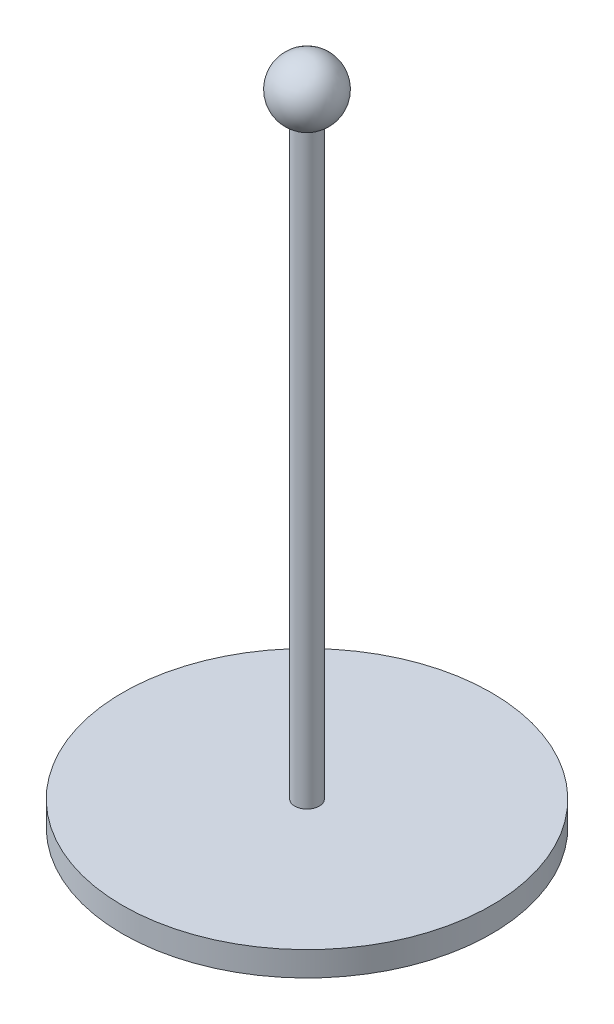
ISO-10303-21;
HEADER;
FILE_DESCRIPTION(('STEP AP214'),'2;1');
FILE_NAME('part.step','',(''),(''),'','','');
FILE_SCHEMA(('AUTOMOTIVE_DESIGN { 1 0 10303 214 1 1 1 1 }'));
ENDSEC;
DATA;
#1=APPLICATION_CONTEXT('core data for automotive mechanical design processes');
#2=APPLICATION_PROTOCOL_DEFINITION('international standard','automotive_design',2000,#1);
#3=PRODUCT_CONTEXT('',#1,'mechanical');
#4=PRODUCT('Part','Part','',(#3));
#5=PRODUCT_RELATED_PRODUCT_CATEGORY('part','',(#4));
#6=PRODUCT_DEFINITION_FORMATION('','',#4);
#7=PRODUCT_DEFINITION_CONTEXT('part definition',#1,'design');
#8=PRODUCT_DEFINITION('design','',#6,#7);
#9=PRODUCT_DEFINITION_SHAPE('','',#8);
#10=(LENGTH_UNIT() NAMED_UNIT(*) SI_UNIT(.MILLI.,.METRE.));
#11=(NAMED_UNIT(*) PLANE_ANGLE_UNIT() SI_UNIT($,.RADIAN.));
#12=(NAMED_UNIT(*) SI_UNIT($,.STERADIAN.) SOLID_ANGLE_UNIT());
#13=UNCERTAINTY_MEASURE_WITH_UNIT(LENGTH_MEASURE(1.E-05),#10,'distance_accuracy_value','');
#14=(GEOMETRIC_REPRESENTATION_CONTEXT(3) GLOBAL_UNCERTAINTY_ASSIGNED_CONTEXT((#13)) GLOBAL_UNIT_ASSIGNED_CONTEXT((#10,
#11,#12)) REPRESENTATION_CONTEXT('',''));
#15=CARTESIAN_POINT('',(0.,0.,0.));
#16=DIRECTION('',(0.,0.,1.));
#17=DIRECTION('',(1.,0.,0.));
#18=AXIS2_PLACEMENT_3D('',#15,#16,#17);
#19=CARTESIAN_POINT('',(0.,260.,0.));
#20=DIRECTION('',(0.,-1.,0.));
#21=DIRECTION('',(0.,0.,-1.));
#22=AXIS2_PLACEMENT_3D('',#19,#20,#21);
#23=CYLINDRICAL_SURFACE('',#22,5.);
#24=CARTESIAN_POINT('',(0.,10.,0.));
#25=DIRECTION('',(0.,1.,0.));
#26=DIRECTION('',(0.,0.,1.));
#27=AXIS2_PLACEMENT_3D('',#24,#25,#26);
#28=CIRCLE('',#27,5.);
#29=CARTESIAN_POINT('',(0.,10.,5.));
#30=VERTEX_POINT('',#29);
#31=EDGE_CURVE('E50',#30,#30,#28,.T.);
#32=ORIENTED_EDGE('',*,*,#31,.T.);
#33=EDGE_LOOP('',(#32));
#34=FACE_BOUND('',#33,.T.);
#35=CARTESIAN_POINT('',(0.,248.54356076261,0.));
#36=DIRECTION('',(0.,1.,0.));
#37=DIRECTION('',(0.,0.,1.));
#38=AXIS2_PLACEMENT_3D('',#35,#36,#37);
#39=CIRCLE('',#38,5.);
#40=CARTESIAN_POINT('',(0.,248.54356076261,5.));
#41=VERTEX_POINT('',#40);
#42=EDGE_CURVE('E10',#41,#41,#39,.T.);
#43=ORIENTED_EDGE('',*,*,#42,.F.);
#44=EDGE_LOOP('',(#43));
#45=FACE_BOUND('',#44,.T.);
#46=ADVANCED_FACE('F34',(#34,#45),#23,.T.);
#47=CARTESIAN_POINT('',(0.,10.,0.));
#48=DIRECTION('',(0.,-1.,0.));
#49=DIRECTION('',(0.,0.,-1.));
#50=AXIS2_PLACEMENT_3D('',#47,#48,#49);
#51=CYLINDRICAL_SURFACE('',#50,75.);
#52=CARTESIAN_POINT('',(0.,10.,0.));
#53=DIRECTION('',(0.,1.,0.));
#54=DIRECTION('',(0.,0.,1.));
#55=AXIS2_PLACEMENT_3D('',#52,#53,#54);
#56=CIRCLE('',#55,75.);
#57=CARTESIAN_POINT('',(0.,10.,75.));
#58=VERTEX_POINT('',#57);
#59=EDGE_CURVE('E41',#58,#58,#56,.T.);
#60=ORIENTED_EDGE('',*,*,#59,.F.);
#61=EDGE_LOOP('',(#60));
#62=FACE_BOUND('',#61,.T.);
#63=CARTESIAN_POINT('',(0.,0.,0.));
#64=DIRECTION('',(0.,1.,0.));
#65=DIRECTION('',(0.,0.,1.));
#66=AXIS2_PLACEMENT_3D('',#63,#64,#65);
#67=CIRCLE('',#66,75.);
#68=CARTESIAN_POINT('',(0.,0.,75.));
#69=VERTEX_POINT('',#68);
#70=EDGE_CURVE('E45',#69,#69,#67,.T.);
#71=ORIENTED_EDGE('',*,*,#70,.T.);
#72=EDGE_LOOP('',(#71));
#73=FACE_BOUND('',#72,.T.);
#74=ADVANCED_FACE('F36',(#62,#73),#51,.T.);
#75=CARTESIAN_POINT('',(0.,10.,0.));
#76=DIRECTION('',(0.,1.,0.));
#77=DIRECTION('',(0.,0.,1.));
#78=AXIS2_PLACEMENT_3D('',#75,#76,#77);
#79=PLANE('',#78);
#80=ORIENTED_EDGE('',*,*,#31,.F.);
#81=EDGE_LOOP('',(#80));
#82=FACE_BOUND('',#81,.T.);
#83=ORIENTED_EDGE('',*,*,#59,.T.);
#84=EDGE_LOOP('',(#83));
#85=FACE_BOUND('',#84,.T.);
#86=ADVANCED_FACE('F57',(#82,#85),#79,.T.);
#87=CARTESIAN_POINT('',(0.,0.,0.));
#88=DIRECTION('',(0.,1.,0.));
#89=DIRECTION('',(0.,0.,1.));
#90=AXIS2_PLACEMENT_3D('',#87,#88,#89);
#91=PLANE('',#90);
#92=ORIENTED_EDGE('',*,*,#70,.F.);
#93=EDGE_LOOP('',(#92));
#94=FACE_BOUND('',#93,.T.);
#95=ADVANCED_FACE('F59',(#94),#91,.F.);
#96=CARTESIAN_POINT('',(0.,260.,0.));
#97=DIRECTION('',(0.,1.,0.));
#98=DIRECTION('',(0.,0.,-1.));
#99=AXIS2_PLACEMENT_3D('',#96,#97,#98);
#100=SPHERICAL_SURFACE('',#99,12.5);
#101=ORIENTED_EDGE('',*,*,#42,.T.);
#102=EDGE_LOOP('',(#101));
#103=FACE_BOUND('',#102,.T.);
#104=ADVANCED_FACE('F65',(#103),#100,.T.);
#105=CLOSED_SHELL('',(#46,#74,#86,#95,#104));
#106=MANIFOLD_SOLID_BREP('B2',#105);
#107=ADVANCED_BREP_SHAPE_REPRESENTATION('',(#18,#106),#14);
#108=SHAPE_DEFINITION_REPRESENTATION(#9,#107);
ENDSEC;
END-ISO-10303-21;
